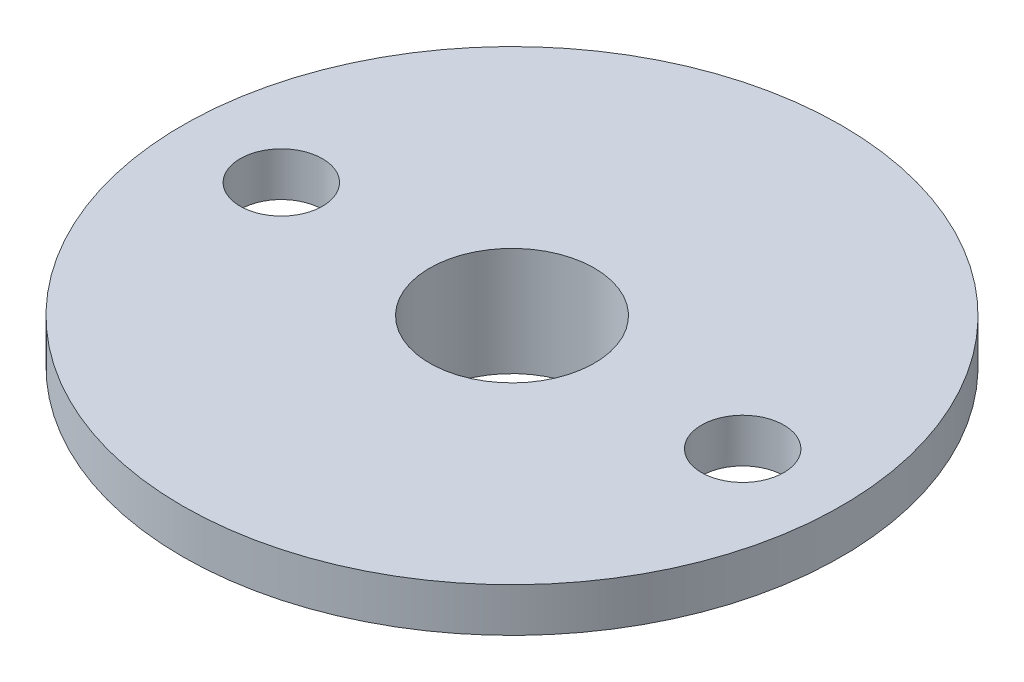
ISO-10303-21;
HEADER;
FILE_DESCRIPTION(('STEP AP214'),'2;1');
FILE_NAME('part.step','',(''),(''),'','','');
FILE_SCHEMA(('AUTOMOTIVE_DESIGN { 1 0 10303 214 1 1 1 1 }'));
ENDSEC;
DATA;
#1=APPLICATION_CONTEXT('core data for automotive mechanical design processes');
#2=APPLICATION_PROTOCOL_DEFINITION('international standard','automotive_design',2000,#1);
#3=PRODUCT_CONTEXT('',#1,'mechanical');
#4=PRODUCT('Part','Part','',(#3));
#5=PRODUCT_RELATED_PRODUCT_CATEGORY('part','',(#4));
#6=PRODUCT_DEFINITION_FORMATION('','',#4);
#7=PRODUCT_DEFINITION_CONTEXT('part definition',#1,'design');
#8=PRODUCT_DEFINITION('design','',#6,#7);
#9=PRODUCT_DEFINITION_SHAPE('','',#8);
#10=(LENGTH_UNIT() NAMED_UNIT(*) SI_UNIT(.MILLI.,.METRE.));
#11=(NAMED_UNIT(*) PLANE_ANGLE_UNIT() SI_UNIT($,.RADIAN.));
#12=(NAMED_UNIT(*) SI_UNIT($,.STERADIAN.) SOLID_ANGLE_UNIT());
#13=UNCERTAINTY_MEASURE_WITH_UNIT(LENGTH_MEASURE(1.E-05),#10,'distance_accuracy_value','');
#14=(GEOMETRIC_REPRESENTATION_CONTEXT(3) GLOBAL_UNCERTAINTY_ASSIGNED_CONTEXT((#13)) GLOBAL_UNIT_ASSIGNED_CONTEXT((#10,
#11,#12)) REPRESENTATION_CONTEXT('',''));
#15=CARTESIAN_POINT('',(0.,0.,0.));
#16=DIRECTION('',(0.,0.,1.));
#17=DIRECTION('',(1.,0.,0.));
#18=AXIS2_PLACEMENT_3D('',#15,#16,#17);
#19=CARTESIAN_POINT('',(0.,0.,0.));
#20=DIRECTION('',(0.,-1.,0.));
#21=DIRECTION('',(0.,0.,-1.));
#22=AXIS2_PLACEMENT_3D('',#19,#20,#21);
#23=CYLINDRICAL_SURFACE('',#22,3.);
#24=CARTESIAN_POINT('',(0.,-3.95,0.));
#25=DIRECTION('',(0.,-1.,0.));
#26=DIRECTION('',(0.,0.,-1.));
#27=AXIS2_PLACEMENT_3D('',#24,#25,#26);
#28=CIRCLE('',#27,3.);
#29=CARTESIAN_POINT('',(0.,-3.95,-3.));
#30=VERTEX_POINT('',#29);
#31=EDGE_CURVE('E47',#30,#30,#28,.T.);
#32=ORIENTED_EDGE('',*,*,#31,.T.);
#33=EDGE_LOOP('',(#32));
#34=FACE_BOUND('',#33,.T.);
#35=CARTESIAN_POINT('',(0.,0.,0.));
#36=DIRECTION('',(0.,-1.,0.));
#37=DIRECTION('',(0.,0.,-1.));
#38=AXIS2_PLACEMENT_3D('',#35,#36,#37);
#39=CIRCLE('',#38,3.);
#40=CARTESIAN_POINT('',(0.,0.,-3.));
#41=VERTEX_POINT('',#40);
#42=EDGE_CURVE('E10',#41,#41,#39,.T.);
#43=ORIENTED_EDGE('',*,*,#42,.F.);
#44=EDGE_LOOP('',(#43));
#45=FACE_BOUND('',#44,.T.);
#46=ADVANCED_FACE('F30',(#34,#45),#23,.F.);
#47=CARTESIAN_POINT('',(3.,0.,0.));
#48=DIRECTION('',(0.,1.,0.));
#49=DIRECTION('',(0.,0.,1.));
#50=AXIS2_PLACEMENT_3D('',#47,#48,#49);
#51=PLANE('',#50);
#52=CARTESIAN_POINT('',(-8.40000000000001,0.,0.));
#53=DIRECTION('',(0.,1.,0.));
#54=DIRECTION('',(0.,0.,-1.));
#55=AXIS2_PLACEMENT_3D('',#52,#53,#54);
#56=CIRCLE('',#55,1.5);
#57=CARTESIAN_POINT('',(-8.40000000000001,0.,-1.5));
#58=VERTEX_POINT('',#57);
#59=EDGE_CURVE('E59',#58,#58,#56,.T.);
#60=ORIENTED_EDGE('',*,*,#59,.F.);
#61=EDGE_LOOP('',(#60));
#62=FACE_BOUND('',#61,.T.);
#63=CARTESIAN_POINT('',(8.4,0.,0.));
#64=DIRECTION('',(0.,1.,0.));
#65=DIRECTION('',(0.,0.,1.));
#66=AXIS2_PLACEMENT_3D('',#63,#64,#65);
#67=CIRCLE('',#66,1.5);
#68=CARTESIAN_POINT('',(8.4,0.,1.5));
#69=VERTEX_POINT('',#68);
#70=EDGE_CURVE('E48',#69,#69,#67,.T.);
#71=ORIENTED_EDGE('',*,*,#70,.F.);
#72=EDGE_LOOP('',(#71));
#73=FACE_BOUND('',#72,.T.);
#74=ORIENTED_EDGE('',*,*,#42,.T.);
#75=EDGE_LOOP('',(#74));
#76=FACE_BOUND('',#75,.T.);
#77=CARTESIAN_POINT('',(0.,0.,0.));
#78=DIRECTION('',(0.,-1.,0.));
#79=DIRECTION('',(0.,0.,-1.));
#80=AXIS2_PLACEMENT_3D('',#77,#78,#79);
#81=CIRCLE('',#80,12.);
#82=CARTESIAN_POINT('',(0.,0.,-12.));
#83=VERTEX_POINT('',#82);
#84=EDGE_CURVE('E37',#83,#83,#81,.T.);
#85=ORIENTED_EDGE('',*,*,#84,.F.);
#86=EDGE_LOOP('',(#85));
#87=FACE_BOUND('',#86,.T.);
#88=ADVANCED_FACE('F74',(#62,#73,#76,#87),#51,.T.);
#89=CARTESIAN_POINT('',(0.,0.,0.));
#90=DIRECTION('',(0.,-1.,0.));
#91=DIRECTION('',(0.,0.,-1.));
#92=AXIS2_PLACEMENT_3D('',#89,#90,#91);
#93=CYLINDRICAL_SURFACE('',#92,12.);
#94=ORIENTED_EDGE('',*,*,#84,.T.);
#95=EDGE_LOOP('',(#94));
#96=FACE_BOUND('',#95,.T.);
#97=CARTESIAN_POINT('',(0.,-1.6,0.));
#98=DIRECTION('',(0.,-1.,0.));
#99=DIRECTION('',(0.,0.,-1.));
#100=AXIS2_PLACEMENT_3D('',#97,#98,#99);
#101=CIRCLE('',#100,12.);
#102=CARTESIAN_POINT('',(0.,-1.6,-12.));
#103=VERTEX_POINT('',#102);
#104=EDGE_CURVE('E42',#103,#103,#101,.T.);
#105=ORIENTED_EDGE('',*,*,#104,.F.);
#106=EDGE_LOOP('',(#105));
#107=FACE_BOUND('',#106,.T.);
#108=ADVANCED_FACE('F72',(#96,#107),#93,.T.);
#109=CARTESIAN_POINT('',(12.,-1.6,0.));
#110=DIRECTION('',(0.,-1.,0.));
#111=DIRECTION('',(0.,0.,-1.));
#112=AXIS2_PLACEMENT_3D('',#109,#110,#111);
#113=PLANE('',#112);
#114=CARTESIAN_POINT('',(-8.40000000000001,-1.6,0.));
#115=DIRECTION('',(0.,-1.,0.));
#116=DIRECTION('',(0.,0.,-1.));
#117=AXIS2_PLACEMENT_3D('',#114,#115,#116);
#118=CIRCLE('',#117,1.5);
#119=CARTESIAN_POINT('',(-8.40000000000001,-1.6,-1.5));
#120=VERTEX_POINT('',#119);
#121=EDGE_CURVE('E33',#120,#120,#118,.T.);
#122=ORIENTED_EDGE('',*,*,#121,.F.);
#123=EDGE_LOOP('',(#122));
#124=FACE_BOUND('',#123,.T.);
#125=CARTESIAN_POINT('',(8.4,-1.6,0.));
#126=DIRECTION('',(0.,-1.,0.));
#127=DIRECTION('',(0.,0.,-1.));
#128=AXIS2_PLACEMENT_3D('',#125,#126,#127);
#129=CIRCLE('',#128,1.5);
#130=CARTESIAN_POINT('',(8.4,-1.6,-1.5));
#131=VERTEX_POINT('',#130);
#132=EDGE_CURVE('E45',#131,#131,#129,.T.);
#133=ORIENTED_EDGE('',*,*,#132,.F.);
#134=EDGE_LOOP('',(#133));
#135=FACE_BOUND('',#134,.T.);
#136=ORIENTED_EDGE('',*,*,#104,.T.);
#137=EDGE_LOOP('',(#136));
#138=FACE_BOUND('',#137,.T.);
#139=CARTESIAN_POINT('',(0.,-1.6,0.));
#140=DIRECTION('',(0.,-1.,0.));
#141=DIRECTION('',(0.,0.,-1.));
#142=AXIS2_PLACEMENT_3D('',#139,#140,#141);
#143=CIRCLE('',#142,5.);
#144=CARTESIAN_POINT('',(0.,-1.6,-5.));
#145=VERTEX_POINT('',#144);
#146=EDGE_CURVE('E64',#145,#145,#143,.T.);
#147=ORIENTED_EDGE('',*,*,#146,.F.);
#148=EDGE_LOOP('',(#147));
#149=FACE_BOUND('',#148,.T.);
#150=ADVANCED_FACE('F69',(#124,#135,#138,#149),#113,.T.);
#151=CARTESIAN_POINT('',(0.,0.,0.));
#152=DIRECTION('',(0.,-1.,0.));
#153=DIRECTION('',(0.,0.,-1.));
#154=AXIS2_PLACEMENT_3D('',#151,#152,#153);
#155=CYLINDRICAL_SURFACE('',#154,5.);
#156=ORIENTED_EDGE('',*,*,#146,.T.);
#157=EDGE_LOOP('',(#156));
#158=FACE_BOUND('',#157,.T.);
#159=CARTESIAN_POINT('',(0.,-3.95,0.));
#160=DIRECTION('',(0.,-1.,0.));
#161=DIRECTION('',(0.,0.,-1.));
#162=AXIS2_PLACEMENT_3D('',#159,#160,#161);
#163=CIRCLE('',#162,5.);
#164=CARTESIAN_POINT('',(0.,-3.95,-5.));
#165=VERTEX_POINT('',#164);
#166=EDGE_CURVE('E52',#165,#165,#163,.T.);
#167=ORIENTED_EDGE('',*,*,#166,.F.);
#168=EDGE_LOOP('',(#167));
#169=FACE_BOUND('',#168,.T.);
#170=ADVANCED_FACE('F81',(#158,#169),#155,.T.);
#171=CARTESIAN_POINT('',(5.,-3.95,0.));
#172=DIRECTION('',(0.,-1.,0.));
#173=DIRECTION('',(0.,0.,-1.));
#174=AXIS2_PLACEMENT_3D('',#171,#172,#173);
#175=PLANE('',#174);
#176=ORIENTED_EDGE('',*,*,#166,.T.);
#177=EDGE_LOOP('',(#176));
#178=FACE_BOUND('',#177,.T.);
#179=ORIENTED_EDGE('',*,*,#31,.F.);
#180=EDGE_LOOP('',(#179));
#181=FACE_BOUND('',#180,.T.);
#182=ADVANCED_FACE('F92',(#178,#181),#175,.T.);
#183=CARTESIAN_POINT('',(8.4,-3.95,0.));
#184=DIRECTION('',(0.,1.,0.));
#185=DIRECTION('',(0.,0.,1.));
#186=AXIS2_PLACEMENT_3D('',#183,#184,#185);
#187=CYLINDRICAL_SURFACE('',#186,1.5);
#188=ORIENTED_EDGE('',*,*,#132,.T.);
#189=EDGE_LOOP('',(#188));
#190=FACE_BOUND('',#189,.T.);
#191=ORIENTED_EDGE('',*,*,#70,.T.);
#192=EDGE_LOOP('',(#191));
#193=FACE_BOUND('',#192,.T.);
#194=ADVANCED_FACE('F94',(#190,#193),#187,.F.);
#195=CARTESIAN_POINT('',(-8.40000000000001,-3.95,0.));
#196=DIRECTION('',(0.,1.,0.));
#197=DIRECTION('',(0.,0.,1.));
#198=AXIS2_PLACEMENT_3D('',#195,#196,#197);
#199=CYLINDRICAL_SURFACE('',#198,1.5);
#200=ORIENTED_EDGE('',*,*,#121,.T.);
#201=EDGE_LOOP('',(#200));
#202=FACE_BOUND('',#201,.T.);
#203=ORIENTED_EDGE('',*,*,#59,.T.);
#204=EDGE_LOOP('',(#203));
#205=FACE_BOUND('',#204,.T.);
#206=ADVANCED_FACE('F101',(#202,#205),#199,.F.);
#207=CLOSED_SHELL('',(#46,#88,#108,#150,#170,#182,#194,#206));
#208=MANIFOLD_SOLID_BREP('B2',#207);
#209=ADVANCED_BREP_SHAPE_REPRESENTATION('',(#18,#208),#14);
#210=SHAPE_DEFINITION_REPRESENTATION(#9,#209);
ENDSEC;
END-ISO-10303-21;
